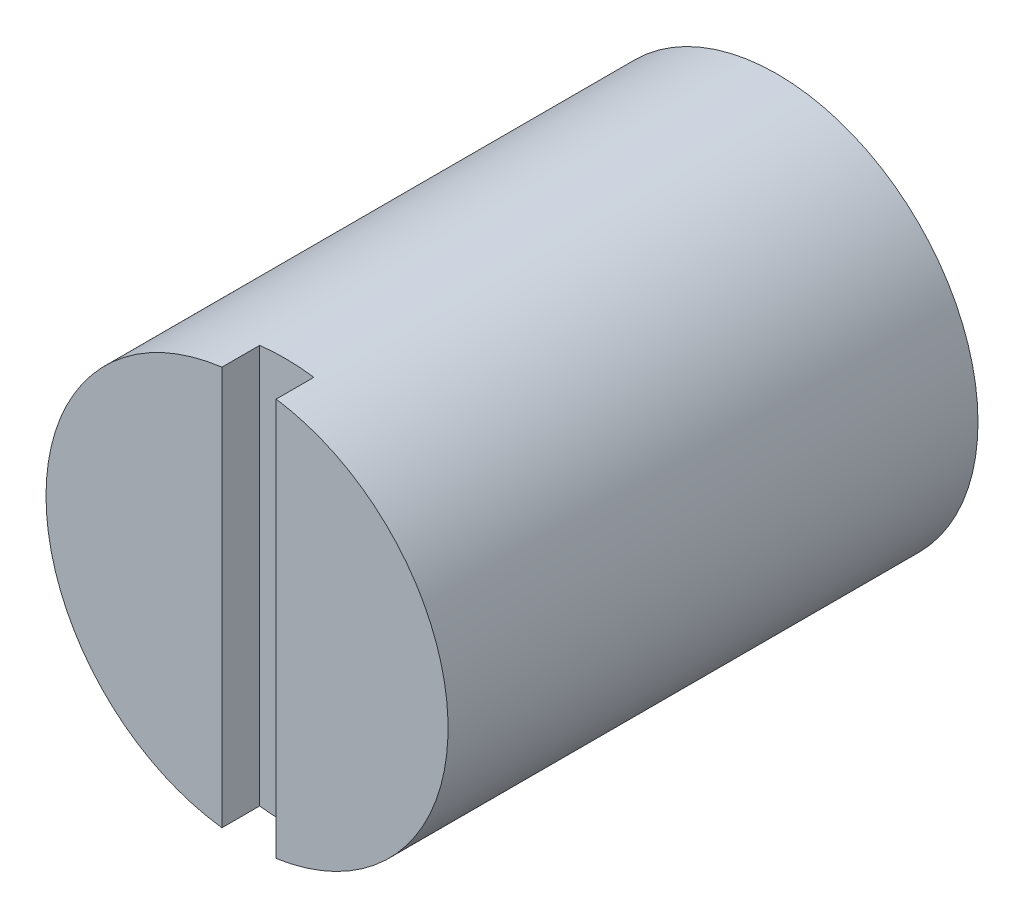
ISO-10303-21;
HEADER;
FILE_DESCRIPTION(('STEP AP214'),'2;1');
FILE_NAME('part.step','',(''),(''),'','','');
FILE_SCHEMA(('AUTOMOTIVE_DESIGN { 1 0 10303 214 1 1 1 1 }'));
ENDSEC;
DATA;
#1=APPLICATION_CONTEXT('core data for automotive mechanical design processes');
#2=APPLICATION_PROTOCOL_DEFINITION('international standard','automotive_design',2000,#1);
#3=PRODUCT_CONTEXT('',#1,'mechanical');
#4=PRODUCT('Part','Part','',(#3));
#5=PRODUCT_RELATED_PRODUCT_CATEGORY('part','',(#4));
#6=PRODUCT_DEFINITION_FORMATION('','',#4);
#7=PRODUCT_DEFINITION_CONTEXT('part definition',#1,'design');
#8=PRODUCT_DEFINITION('design','',#6,#7);
#9=PRODUCT_DEFINITION_SHAPE('','',#8);
#10=(LENGTH_UNIT() NAMED_UNIT(*) SI_UNIT(.MILLI.,.METRE.));
#11=(NAMED_UNIT(*) PLANE_ANGLE_UNIT() SI_UNIT($,.RADIAN.));
#12=(NAMED_UNIT(*) SI_UNIT($,.STERADIAN.) SOLID_ANGLE_UNIT());
#13=UNCERTAINTY_MEASURE_WITH_UNIT(LENGTH_MEASURE(1.E-05),#10,'distance_accuracy_value','');
#14=(GEOMETRIC_REPRESENTATION_CONTEXT(3) GLOBAL_UNCERTAINTY_ASSIGNED_CONTEXT((#13)) GLOBAL_UNIT_ASSIGNED_CONTEXT((#10,
#11,#12)) REPRESENTATION_CONTEXT('',''));
#15=CARTESIAN_POINT('',(0.,0.,0.));
#16=DIRECTION('',(0.,0.,1.));
#17=DIRECTION('',(1.,0.,0.));
#18=AXIS2_PLACEMENT_3D('',#15,#16,#17);
#19=CARTESIAN_POINT('',(643.462516355469,441.5682812,57.978675));
#20=DIRECTION('',(0.,0.,-1.));
#21=DIRECTION('',(-1.,0.,0.));
#22=AXIS2_PLACEMENT_3D('',#19,#20,#21);
#23=PLANE('',#22);
#24=DIRECTION('',(0.,1.,0.));
#25=VECTOR('',#24,1.);
#26=CARTESIAN_POINT('',(643.462516355469,441.5682812,57.978675));
#27=LINE('',#26,#25);
#28=CARTESIAN_POINT('',(643.462516355469,428.935232448719,57.978675));
#29=VERTEX_POINT('',#28);
#30=CARTESIAN_POINT('',(643.462516355469,441.501380751281,57.978675));
#31=VERTEX_POINT('',#30);
#32=EDGE_CURVE('E60',#29,#31,#27,.T.);
#33=ORIENTED_EDGE('',*,*,#32,.T.);
#34=CARTESIAN_POINT('',(642.543192348307,435.2183066,57.978675));
#35=DIRECTION('',(0.,0.,-1.));
#36=DIRECTION('',(-1.,0.,0.));
#37=AXIS2_PLACEMENT_3D('',#34,#35,#36);
#38=CIRCLE('',#37,6.34997460000008);
#39=CARTESIAN_POINT('',(641.749442348307,441.518476308678,57.978675));
#40=VERTEX_POINT('',#39);
#41=EDGE_CURVE('E19',#40,#31,#38,.T.);
#42=ORIENTED_EDGE('',*,*,#41,.F.);
#43=DIRECTION('',(0.,1.,0.));
#44=VECTOR('',#43,1.);
#45=CARTESIAN_POINT('',(641.749442348307,441.5682812,57.978675));
#46=LINE('',#45,#44);
#47=CARTESIAN_POINT('',(641.749442348307,428.918136891322,57.978675));
#48=VERTEX_POINT('',#47);
#49=EDGE_CURVE('E64',#40,#48,#46,.F.);
#50=ORIENTED_EDGE('',*,*,#49,.T.);
#51=CARTESIAN_POINT('',(642.543192348307,435.2183066,57.978675));
#52=DIRECTION('',(0.,0.,-1.));
#53=DIRECTION('',(-1.,0.,0.));
#54=AXIS2_PLACEMENT_3D('',#51,#52,#53);
#55=CIRCLE('',#54,6.34997460000008);
#56=EDGE_CURVE('E58',#29,#48,#55,.T.);
#57=ORIENTED_EDGE('',*,*,#56,.F.);
#58=EDGE_LOOP('',(#33,#42,#50,#57));
#59=FACE_BOUND('',#58,.T.);
#60=ADVANCED_FACE('F16',(#59),#23,.F.);
#61=CARTESIAN_POINT('',(641.749442348307,441.5682812,58.772425));
#62=DIRECTION('',(-1.,0.,0.));
#63=DIRECTION('',(0.,0.,1.));
#64=AXIS2_PLACEMENT_3D('',#61,#62,#63);
#65=PLANE('',#64);
#66=ORIENTED_EDGE('',*,*,#49,.F.);
#67=DIRECTION('',(0.,0.,1.));
#68=VECTOR('',#67,1.);
#69=CARTESIAN_POINT('',(641.749442348307,441.518476308678,58.772425));
#70=LINE('',#69,#68);
#71=CARTESIAN_POINT('',(641.749442348307,441.518476308678,59.1693));
#72=VERTEX_POINT('',#71);
#73=EDGE_CURVE('E51',#72,#40,#70,.F.);
#74=ORIENTED_EDGE('',*,*,#73,.F.);
#75=DIRECTION('',(0.,1.,0.));
#76=VECTOR('',#75,1.);
#77=CARTESIAN_POINT('',(641.749442348307,435.2183066,59.1693));
#78=LINE('',#77,#76);
#79=CARTESIAN_POINT('',(641.749442348307,428.918136891322,59.1693));
#80=VERTEX_POINT('',#79);
#81=EDGE_CURVE('E78',#80,#72,#78,.T.);
#82=ORIENTED_EDGE('',*,*,#81,.F.);
#83=DIRECTION('',(0.,0.,-1.));
#84=VECTOR('',#83,1.);
#85=CARTESIAN_POINT('',(641.749442348307,428.918136891322,42.4307));
#86=LINE('',#85,#84);
#87=EDGE_CURVE('E72',#48,#80,#86,.F.);
#88=ORIENTED_EDGE('',*,*,#87,.F.);
#89=EDGE_LOOP('',(#66,#74,#82,#88));
#90=FACE_BOUND('',#89,.T.);
#91=ADVANCED_FACE('F87',(#90),#65,.F.);
#92=CARTESIAN_POINT('',(643.462516355469,441.5682812,59.1693));
#93=DIRECTION('',(1.,0.,0.));
#94=DIRECTION('',(0.,0.,-1.));
#95=AXIS2_PLACEMENT_3D('',#92,#93,#94);
#96=PLANE('',#95);
#97=DIRECTION('',(0.,1.,0.));
#98=VECTOR('',#97,1.);
#99=CARTESIAN_POINT('',(643.462516355469,435.2183066,59.1693));
#100=LINE('',#99,#98);
#101=CARTESIAN_POINT('',(643.462516355469,441.501380751281,59.1693));
#102=VERTEX_POINT('',#101);
#103=CARTESIAN_POINT('',(643.462516355469,428.935232448719,59.1693));
#104=VERTEX_POINT('',#103);
#105=EDGE_CURVE('E68',#102,#104,#100,.F.);
#106=ORIENTED_EDGE('',*,*,#105,.F.);
#107=DIRECTION('',(0.,0.,-1.));
#108=VECTOR('',#107,1.);
#109=CARTESIAN_POINT('',(643.462516355469,441.501380751282,59.1693));
#110=LINE('',#109,#108);
#111=EDGE_CURVE('E33',#31,#102,#110,.F.);
#112=ORIENTED_EDGE('',*,*,#111,.F.);
#113=ORIENTED_EDGE('',*,*,#32,.F.);
#114=DIRECTION('',(0.,0.,-1.));
#115=VECTOR('',#114,1.);
#116=CARTESIAN_POINT('',(643.462516355469,428.935232448719,42.4307));
#117=LINE('',#116,#115);
#118=EDGE_CURVE('E70',#104,#29,#117,.T.);
#119=ORIENTED_EDGE('',*,*,#118,.F.);
#120=EDGE_LOOP('',(#106,#112,#113,#119));
#121=FACE_BOUND('',#120,.T.);
#122=ADVANCED_FACE('F66',(#121),#96,.F.);
#123=CARTESIAN_POINT('',(642.543192348307,435.2183066,42.4307));
#124=DIRECTION('',(0.,0.,1.));
#125=DIRECTION('',(1.,0.,0.));
#126=AXIS2_PLACEMENT_3D('',#123,#124,#125);
#127=PLANE('',#126);
#128=CARTESIAN_POINT('',(642.543192348307,435.2183066,42.4307));
#129=DIRECTION('',(0.,0.,-1.));
#130=DIRECTION('',(-1.,0.,0.));
#131=AXIS2_PLACEMENT_3D('',#128,#129,#130);
#132=CIRCLE('',#131,6.34997460000008);
#133=CARTESIAN_POINT('',(636.193217748307,435.2183066,42.4307));
#134=VERTEX_POINT('',#133);
#135=EDGE_CURVE('E82',#134,#134,#132,.F.);
#136=ORIENTED_EDGE('',*,*,#135,.F.);
#137=EDGE_LOOP('',(#136));
#138=FACE_BOUND('',#137,.T.);
#139=ADVANCED_FACE('F103',(#138),#127,.F.);
#140=CARTESIAN_POINT('',(648.893166948307,435.2183066,59.1693));
#141=DIRECTION('',(0.,0.,1.));
#142=DIRECTION('',(1.,0.,0.));
#143=AXIS2_PLACEMENT_3D('',#140,#141,#142);
#144=PLANE('',#143);
#145=CARTESIAN_POINT('',(642.543192348307,435.2183066,59.1693));
#146=DIRECTION('',(0.,0.,-1.));
#147=DIRECTION('',(-1.,0.,0.));
#148=AXIS2_PLACEMENT_3D('',#145,#146,#147);
#149=CIRCLE('',#148,6.34997460000008);
#150=EDGE_CURVE('E25',#80,#72,#149,.T.);
#151=ORIENTED_EDGE('',*,*,#150,.F.);
#152=ORIENTED_EDGE('',*,*,#81,.T.);
#153=EDGE_LOOP('',(#151,#152));
#154=FACE_BOUND('',#153,.T.);
#155=ADVANCED_FACE('F94',(#154),#144,.T.);
#156=CARTESIAN_POINT('',(648.893166948307,435.2183066,59.1693));
#157=DIRECTION('',(0.,0.,1.));
#158=DIRECTION('',(1.,0.,0.));
#159=AXIS2_PLACEMENT_3D('',#156,#157,#158);
#160=PLANE('',#159);
#161=ORIENTED_EDGE('',*,*,#105,.T.);
#162=CARTESIAN_POINT('',(642.543192348307,435.2183066,59.1693));
#163=DIRECTION('',(0.,0.,-1.));
#164=DIRECTION('',(-1.,0.,0.));
#165=AXIS2_PLACEMENT_3D('',#162,#163,#164);
#166=CIRCLE('',#165,6.34997460000008);
#167=EDGE_CURVE('E11',#102,#104,#166,.T.);
#168=ORIENTED_EDGE('',*,*,#167,.F.);
#169=EDGE_LOOP('',(#161,#168));
#170=FACE_BOUND('',#169,.T.);
#171=ADVANCED_FACE('F92',(#170),#160,.T.);
#172=CARTESIAN_POINT('',(642.543192348307,435.2183066,42.4307));
#173=DIRECTION('',(0.,0.,-1.));
#174=DIRECTION('',(-1.,0.,0.));
#175=AXIS2_PLACEMENT_3D('',#172,#173,#174);
#176=CYLINDRICAL_SURFACE('',#175,6.34997460000008);
#177=ORIENTED_EDGE('',*,*,#135,.T.);
#178=EDGE_LOOP('',(#177));
#179=FACE_BOUND('',#178,.T.);
#180=ORIENTED_EDGE('',*,*,#111,.T.);
#181=ORIENTED_EDGE('',*,*,#167,.T.);
#182=ORIENTED_EDGE('',*,*,#118,.T.);
#183=ORIENTED_EDGE('',*,*,#56,.T.);
#184=ORIENTED_EDGE('',*,*,#87,.T.);
#185=ORIENTED_EDGE('',*,*,#150,.T.);
#186=ORIENTED_EDGE('',*,*,#73,.T.);
#187=ORIENTED_EDGE('',*,*,#41,.T.);
#188=EDGE_LOOP('',(#180,#181,#182,#183,#184,#185,#186,#187));
#189=FACE_BOUND('',#188,.T.);
#190=ADVANCED_FACE('F54',(#179,#189),#176,.T.);
#191=CLOSED_SHELL('',(#60,#91,#122,#139,#155,#171,#190));
#192=MANIFOLD_SOLID_BREP('B1',#191);
#193=ADVANCED_BREP_SHAPE_REPRESENTATION('',(#18,#192),#14);
#194=SHAPE_DEFINITION_REPRESENTATION(#9,#193);
ENDSEC;
END-ISO-10303-21;
